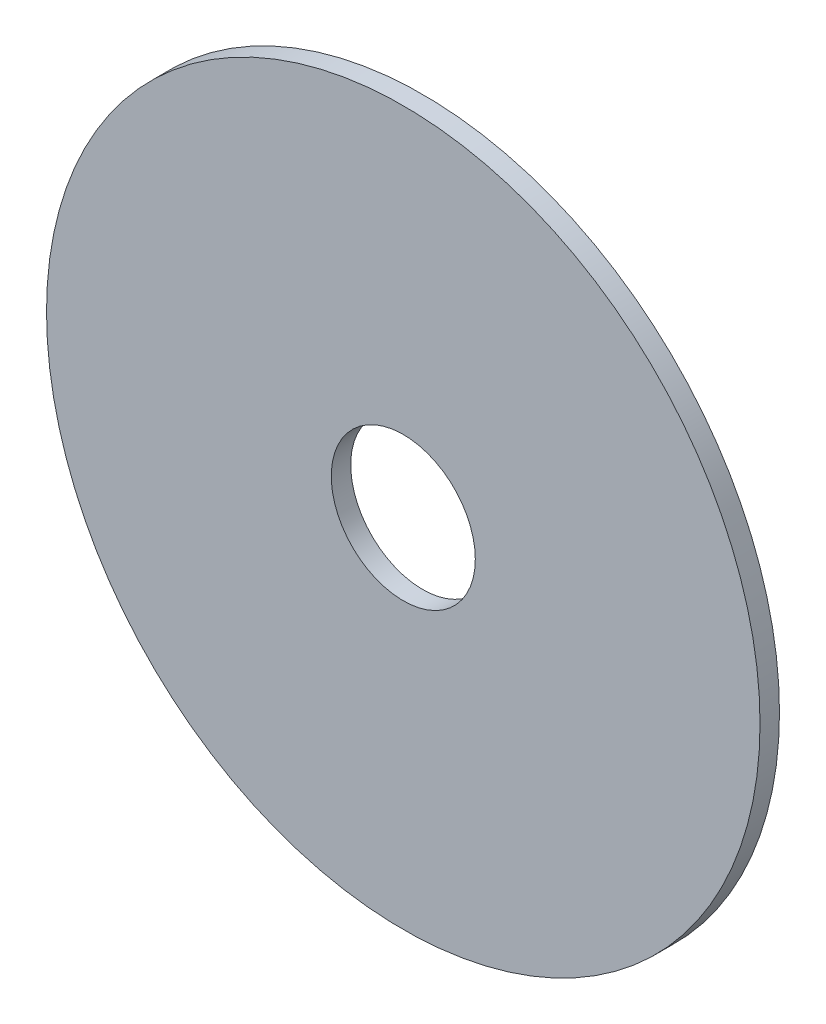
ISO-10303-21;
HEADER;
FILE_DESCRIPTION(('STEP AP214'),'2;1');
FILE_NAME('part.step','',(''),(''),'','','');
FILE_SCHEMA(('AUTOMOTIVE_DESIGN { 1 0 10303 214 1 1 1 1 }'));
ENDSEC;
DATA;
#1=APPLICATION_CONTEXT('core data for automotive mechanical design processes');
#2=APPLICATION_PROTOCOL_DEFINITION('international standard','automotive_design',2000,#1);
#3=PRODUCT_CONTEXT('',#1,'mechanical');
#4=PRODUCT('Part','Part','',(#3));
#5=PRODUCT_RELATED_PRODUCT_CATEGORY('part','',(#4));
#6=PRODUCT_DEFINITION_FORMATION('','',#4);
#7=PRODUCT_DEFINITION_CONTEXT('part definition',#1,'design');
#8=PRODUCT_DEFINITION('design','',#6,#7);
#9=PRODUCT_DEFINITION_SHAPE('','',#8);
#10=(LENGTH_UNIT() NAMED_UNIT(*) SI_UNIT(.MILLI.,.METRE.));
#11=(NAMED_UNIT(*) PLANE_ANGLE_UNIT() SI_UNIT($,.RADIAN.));
#12=(NAMED_UNIT(*) SI_UNIT($,.STERADIAN.) SOLID_ANGLE_UNIT());
#13=UNCERTAINTY_MEASURE_WITH_UNIT(LENGTH_MEASURE(1.E-05),#10,'distance_accuracy_value','');
#14=(GEOMETRIC_REPRESENTATION_CONTEXT(3) GLOBAL_UNCERTAINTY_ASSIGNED_CONTEXT((#13)) GLOBAL_UNIT_ASSIGNED_CONTEXT((#10,
#11,#12)) REPRESENTATION_CONTEXT('',''));
#15=CARTESIAN_POINT('',(0.,0.,0.));
#16=DIRECTION('',(0.,0.,1.));
#17=DIRECTION('',(1.,0.,0.));
#18=AXIS2_PLACEMENT_3D('',#15,#16,#17);
#19=CARTESIAN_POINT('',(0.,0.,3.429));
#20=DIRECTION('',(0.,0.,-1.));
#21=DIRECTION('',(-1.,0.,0.));
#22=AXIS2_PLACEMENT_3D('',#19,#20,#21);
#23=PLANE('',#22);
#24=CARTESIAN_POINT('',(0.,0.,3.429));
#25=DIRECTION('',(0.,0.,1.));
#26=DIRECTION('',(1.,0.,0.));
#27=AXIS2_PLACEMENT_3D('',#24,#25,#26);
#28=CIRCLE('',#27,12.7);
#29=CARTESIAN_POINT('',(12.7,0.,3.429));
#30=VERTEX_POINT('',#29);
#31=EDGE_CURVE('E27',#30,#30,#28,.F.);
#32=ORIENTED_EDGE('',*,*,#31,.T.);
#33=EDGE_LOOP('',(#32));
#34=FACE_BOUND('',#33,.T.);
#35=CARTESIAN_POINT('',(0.,0.,3.429));
#36=DIRECTION('',(0.,0.,1.));
#37=DIRECTION('',(1.,0.,0.));
#38=AXIS2_PLACEMENT_3D('',#35,#36,#37);
#39=CIRCLE('',#38,62.90437);
#40=CARTESIAN_POINT('',(62.90437,0.,3.429));
#41=VERTEX_POINT('',#40);
#42=EDGE_CURVE('E18',#41,#41,#39,.F.);
#43=ORIENTED_EDGE('',*,*,#42,.F.);
#44=EDGE_LOOP('',(#43));
#45=FACE_BOUND('',#44,.T.);
#46=ADVANCED_FACE('F15',(#34,#45),#23,.F.);
#47=CARTESIAN_POINT('',(0.,0.,0.));
#48=DIRECTION('',(0.,0.,1.));
#49=DIRECTION('',(1.,0.,0.));
#50=AXIS2_PLACEMENT_3D('',#47,#48,#49);
#51=CYLINDRICAL_SURFACE('',#50,62.90437);
#52=CARTESIAN_POINT('',(0.,0.,0.));
#53=DIRECTION('',(0.,0.,1.));
#54=DIRECTION('',(1.,0.,0.));
#55=AXIS2_PLACEMENT_3D('',#52,#53,#54);
#56=CIRCLE('',#55,62.90437);
#57=CARTESIAN_POINT('',(62.90437,0.,0.));
#58=VERTEX_POINT('',#57);
#59=EDGE_CURVE('E22',#58,#58,#56,.F.);
#60=ORIENTED_EDGE('',*,*,#59,.F.);
#61=EDGE_LOOP('',(#60));
#62=FACE_BOUND('',#61,.T.);
#63=ORIENTED_EDGE('',*,*,#42,.T.);
#64=EDGE_LOOP('',(#63));
#65=FACE_BOUND('',#64,.T.);
#66=ADVANCED_FACE('F35',(#62,#65),#51,.T.);
#67=CARTESIAN_POINT('',(0.,0.,0.));
#68=DIRECTION('',(0.,0.,1.));
#69=DIRECTION('',(1.,0.,0.));
#70=AXIS2_PLACEMENT_3D('',#67,#68,#69);
#71=CYLINDRICAL_SURFACE('',#70,12.7);
#72=CARTESIAN_POINT('',(0.,0.,0.));
#73=DIRECTION('',(0.,0.,1.));
#74=DIRECTION('',(1.,0.,0.));
#75=AXIS2_PLACEMENT_3D('',#72,#73,#74);
#76=CIRCLE('',#75,12.7);
#77=CARTESIAN_POINT('',(12.7,0.,0.));
#78=VERTEX_POINT('',#77);
#79=EDGE_CURVE('E10',#78,#78,#76,.T.);
#80=ORIENTED_EDGE('',*,*,#79,.F.);
#81=EDGE_LOOP('',(#80));
#82=FACE_BOUND('',#81,.T.);
#83=ORIENTED_EDGE('',*,*,#31,.F.);
#84=EDGE_LOOP('',(#83));
#85=FACE_BOUND('',#84,.T.);
#86=ADVANCED_FACE('F42',(#82,#85),#71,.F.);
#87=CARTESIAN_POINT('',(0.,0.,0.));
#88=DIRECTION('',(0.,0.,-1.));
#89=DIRECTION('',(-1.,0.,0.));
#90=AXIS2_PLACEMENT_3D('',#87,#88,#89);
#91=PLANE('',#90);
#92=ORIENTED_EDGE('',*,*,#79,.T.);
#93=EDGE_LOOP('',(#92));
#94=FACE_BOUND('',#93,.T.);
#95=ORIENTED_EDGE('',*,*,#59,.T.);
#96=EDGE_LOOP('',(#95));
#97=FACE_BOUND('',#96,.T.);
#98=ADVANCED_FACE('F44',(#94,#97),#91,.T.);
#99=CLOSED_SHELL('',(#46,#66,#86,#98));
#100=MANIFOLD_SOLID_BREP('B1',#99);
#101=ADVANCED_BREP_SHAPE_REPRESENTATION('',(#18,#100),#14);
#102=SHAPE_DEFINITION_REPRESENTATION(#9,#101);
ENDSEC;
END-ISO-10303-21;
